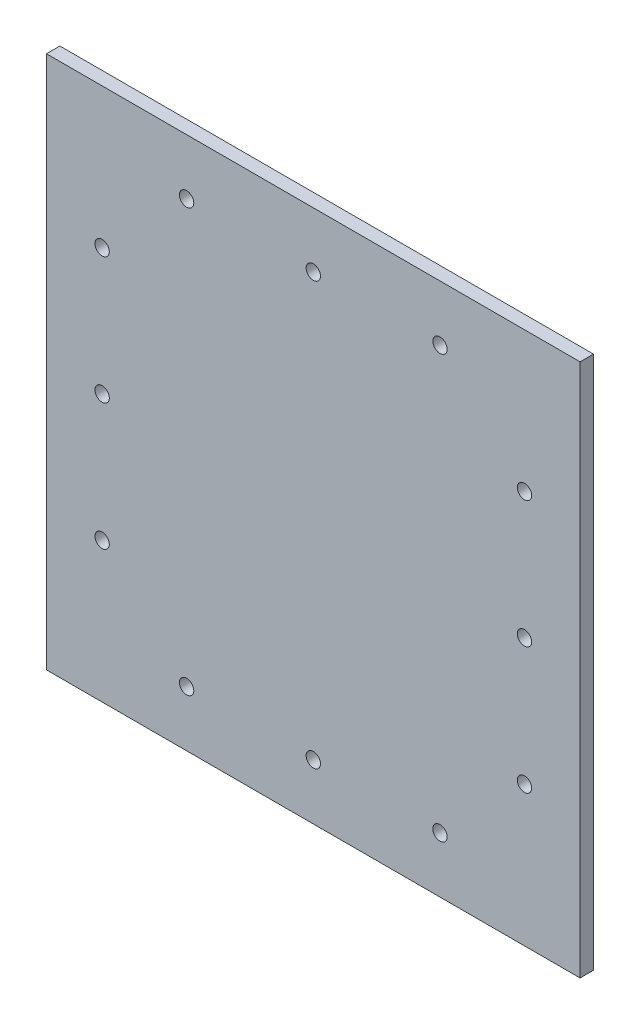
ISO-10303-21;
HEADER;
FILE_DESCRIPTION(('STEP AP214'),'2;1');
FILE_NAME('part.step','',(''),(''),'','','');
FILE_SCHEMA(('AUTOMOTIVE_DESIGN { 1 0 10303 214 1 1 1 1 }'));
ENDSEC;
DATA;
#1=APPLICATION_CONTEXT('core data for automotive mechanical design processes');
#2=APPLICATION_PROTOCOL_DEFINITION('international standard','automotive_design',2000,#1);
#3=PRODUCT_CONTEXT('',#1,'mechanical');
#4=PRODUCT('Part','Part','',(#3));
#5=PRODUCT_RELATED_PRODUCT_CATEGORY('part','',(#4));
#6=PRODUCT_DEFINITION_FORMATION('','',#4);
#7=PRODUCT_DEFINITION_CONTEXT('part definition',#1,'design');
#8=PRODUCT_DEFINITION('design','',#6,#7);
#9=PRODUCT_DEFINITION_SHAPE('','',#8);
#10=(LENGTH_UNIT() NAMED_UNIT(*) SI_UNIT(.MILLI.,.METRE.));
#11=(NAMED_UNIT(*) PLANE_ANGLE_UNIT() SI_UNIT($,.RADIAN.));
#12=(NAMED_UNIT(*) SI_UNIT($,.STERADIAN.) SOLID_ANGLE_UNIT());
#13=UNCERTAINTY_MEASURE_WITH_UNIT(LENGTH_MEASURE(1.E-05),#10,'distance_accuracy_value','');
#14=(GEOMETRIC_REPRESENTATION_CONTEXT(3) GLOBAL_UNCERTAINTY_ASSIGNED_CONTEXT((#13)) GLOBAL_UNIT_ASSIGNED_CONTEXT((#10,
#11,#12)) REPRESENTATION_CONTEXT('',''));
#15=CARTESIAN_POINT('',(0.,0.,0.));
#16=DIRECTION('',(0.,0.,1.));
#17=DIRECTION('',(1.,0.,0.));
#18=AXIS2_PLACEMENT_3D('',#15,#16,#17);
#19=CARTESIAN_POINT('',(-63.1749999999998,-63.175,3.175));
#20=DIRECTION('',(-1.,0.,0.));
#21=DIRECTION('',(0.,0.,1.));
#22=AXIS2_PLACEMENT_3D('',#19,#20,#21);
#23=PLANE('',#22);
#24=DIRECTION('',(0.,1.,0.));
#25=VECTOR('',#24,1.);
#26=CARTESIAN_POINT('',(-63.1749999999998,-63.175,0.));
#27=LINE('',#26,#25);
#28=CARTESIAN_POINT('',(-63.1749999999998,-63.175,0.));
#29=VERTEX_POINT('',#28);
#30=CARTESIAN_POINT('',(-63.1749999999998,63.175,0.));
#31=VERTEX_POINT('',#30);
#32=EDGE_CURVE('E99',#29,#31,#27,.T.);
#33=ORIENTED_EDGE('',*,*,#32,.F.);
#34=DIRECTION('',(0.,0.,-1.));
#35=VECTOR('',#34,1.);
#36=CARTESIAN_POINT('',(-63.1749999999998,-63.175,3.175));
#37=LINE('',#36,#35);
#38=CARTESIAN_POINT('',(-63.1749999999998,-63.175,3.175));
#39=VERTEX_POINT('',#38);
#40=EDGE_CURVE('E11',#39,#29,#37,.T.);
#41=ORIENTED_EDGE('',*,*,#40,.F.);
#42=DIRECTION('',(0.,1.,0.));
#43=VECTOR('',#42,1.);
#44=CARTESIAN_POINT('',(-63.1749999999998,-63.175,3.175));
#45=LINE('',#44,#43);
#46=CARTESIAN_POINT('',(-63.1749999999998,63.175,3.175));
#47=VERTEX_POINT('',#46);
#48=EDGE_CURVE('E93',#39,#47,#45,.T.);
#49=ORIENTED_EDGE('',*,*,#48,.T.);
#50=DIRECTION('',(0.,0.,-1.));
#51=VECTOR('',#50,1.);
#52=CARTESIAN_POINT('',(-63.1749999999998,63.175,3.175));
#53=LINE('',#52,#51);
#54=EDGE_CURVE('E36',#47,#31,#53,.T.);
#55=ORIENTED_EDGE('',*,*,#54,.T.);
#56=EDGE_LOOP('',(#33,#41,#49,#55));
#57=FACE_BOUND('',#56,.T.);
#58=ADVANCED_FACE('F33',(#57),#23,.T.);
#59=CARTESIAN_POINT('',(-63.1749999999998,-63.175,3.175));
#60=DIRECTION('',(0.,1.,0.));
#61=DIRECTION('',(0.,0.,1.));
#62=AXIS2_PLACEMENT_3D('',#59,#60,#61);
#63=PLANE('',#62);
#64=DIRECTION('',(1.,0.,0.));
#65=VECTOR('',#64,1.);
#66=CARTESIAN_POINT('',(-63.1749999999998,-63.175,0.));
#67=LINE('',#66,#65);
#68=CARTESIAN_POINT('',(63.1750000000002,-63.175,0.));
#69=VERTEX_POINT('',#68);
#70=EDGE_CURVE('E66',#29,#69,#67,.T.);
#71=ORIENTED_EDGE('',*,*,#70,.T.);
#72=DIRECTION('',(0.,0.,-1.));
#73=VECTOR('',#72,1.);
#74=CARTESIAN_POINT('',(63.1750000000002,-63.175,3.175));
#75=LINE('',#74,#73);
#76=CARTESIAN_POINT('',(63.1750000000002,-63.175,3.175));
#77=VERTEX_POINT('',#76);
#78=EDGE_CURVE('E42',#77,#69,#75,.T.);
#79=ORIENTED_EDGE('',*,*,#78,.F.);
#80=DIRECTION('',(1.,0.,0.));
#81=VECTOR('',#80,1.);
#82=CARTESIAN_POINT('',(-63.1749999999998,-63.175,3.175));
#83=LINE('',#82,#81);
#84=EDGE_CURVE('E83',#39,#77,#83,.T.);
#85=ORIENTED_EDGE('',*,*,#84,.F.);
#86=ORIENTED_EDGE('',*,*,#40,.T.);
#87=EDGE_LOOP('',(#71,#79,#85,#86));
#88=FACE_BOUND('',#87,.T.);
#89=ADVANCED_FACE('F110',(#88),#63,.F.);
#90=CARTESIAN_POINT('',(63.1750000000002,-63.175,3.175));
#91=DIRECTION('',(-1.,0.,0.));
#92=DIRECTION('',(0.,0.,1.));
#93=AXIS2_PLACEMENT_3D('',#90,#91,#92);
#94=PLANE('',#93);
#95=DIRECTION('',(0.,1.,0.));
#96=VECTOR('',#95,1.);
#97=CARTESIAN_POINT('',(63.1750000000002,-63.175,0.));
#98=LINE('',#97,#96);
#99=CARTESIAN_POINT('',(63.1750000000002,63.175,0.));
#100=VERTEX_POINT('',#99);
#101=EDGE_CURVE('E90',#69,#100,#98,.T.);
#102=ORIENTED_EDGE('',*,*,#101,.T.);
#103=DIRECTION('',(0.,0.,-1.));
#104=VECTOR('',#103,1.);
#105=CARTESIAN_POINT('',(63.1750000000002,63.175,3.175));
#106=LINE('',#105,#104);
#107=CARTESIAN_POINT('',(63.1750000000002,63.175,3.175));
#108=VERTEX_POINT('',#107);
#109=EDGE_CURVE('E87',#108,#100,#106,.T.);
#110=ORIENTED_EDGE('',*,*,#109,.F.);
#111=DIRECTION('',(0.,1.,0.));
#112=VECTOR('',#111,1.);
#113=CARTESIAN_POINT('',(63.1750000000002,-63.175,3.175));
#114=LINE('',#113,#112);
#115=EDGE_CURVE('E78',#77,#108,#114,.T.);
#116=ORIENTED_EDGE('',*,*,#115,.F.);
#117=ORIENTED_EDGE('',*,*,#78,.T.);
#118=EDGE_LOOP('',(#102,#110,#116,#117));
#119=FACE_BOUND('',#118,.T.);
#120=ADVANCED_FACE('F88',(#119),#94,.F.);
#121=CARTESIAN_POINT('',(-63.1749999999998,63.175,3.175));
#122=DIRECTION('',(0.,1.,0.));
#123=DIRECTION('',(0.,0.,1.));
#124=AXIS2_PLACEMENT_3D('',#121,#122,#123);
#125=PLANE('',#124);
#126=DIRECTION('',(1.,0.,0.));
#127=VECTOR('',#126,1.);
#128=CARTESIAN_POINT('',(-63.1749999999998,63.175,0.));
#129=LINE('',#128,#127);
#130=EDGE_CURVE('E102',#31,#100,#129,.T.);
#131=ORIENTED_EDGE('',*,*,#130,.F.);
#132=ORIENTED_EDGE('',*,*,#54,.F.);
#133=DIRECTION('',(1.,0.,0.));
#134=VECTOR('',#133,1.);
#135=CARTESIAN_POINT('',(-63.1749999999998,63.175,3.175));
#136=LINE('',#135,#134);
#137=EDGE_CURVE('E82',#47,#108,#136,.T.);
#138=ORIENTED_EDGE('',*,*,#137,.T.);
#139=ORIENTED_EDGE('',*,*,#109,.T.);
#140=EDGE_LOOP('',(#131,#132,#138,#139));
#141=FACE_BOUND('',#140,.T.);
#142=ADVANCED_FACE('F92',(#141),#125,.T.);
#143=CARTESIAN_POINT('',(0.,0.,3.175));
#144=DIRECTION('',(0.,0.,-1.));
#145=DIRECTION('',(-1.,0.,0.));
#146=AXIS2_PLACEMENT_3D('',#143,#144,#145);
#147=PLANE('',#146);
#148=CARTESIAN_POINT('',(-49.9999999999993,-30.0000000000005,3.175));
#149=DIRECTION('',(0.,0.,-1.));
#150=DIRECTION('',(-1.,0.,0.));
#151=AXIS2_PLACEMENT_3D('',#148,#149,#150);
#152=CIRCLE('',#151,1.7);
#153=CARTESIAN_POINT('',(-51.6999999999993,-30.0000000000005,3.175));
#154=VERTEX_POINT('',#153);
#155=EDGE_CURVE('E103',#154,#154,#152,.T.);
#156=ORIENTED_EDGE('',*,*,#155,.T.);
#157=EDGE_LOOP('',(#156));
#158=FACE_BOUND('',#157,.T.);
#159=CARTESIAN_POINT('',(-49.9999999999997,29.9999999999996,3.175));
#160=DIRECTION('',(0.,0.,-1.));
#161=DIRECTION('',(-1.,0.,0.));
#162=AXIS2_PLACEMENT_3D('',#159,#160,#161);
#163=CIRCLE('',#162,1.69999999999999);
#164=CARTESIAN_POINT('',(-51.6999999999997,29.9999999999996,3.175));
#165=VERTEX_POINT('',#164);
#166=EDGE_CURVE('E221',#165,#165,#163,.T.);
#167=ORIENTED_EDGE('',*,*,#166,.T.);
#168=EDGE_LOOP('',(#167));
#169=FACE_BOUND('',#168,.T.);
#170=CARTESIAN_POINT('',(-49.9999999999994,-4.78783679369599E-13,3.175));
#171=DIRECTION('',(0.,0.,-1.));
#172=DIRECTION('',(-1.,0.,0.));
#173=AXIS2_PLACEMENT_3D('',#170,#171,#172);
#174=CIRCLE('',#173,1.7);
#175=CARTESIAN_POINT('',(-51.6999999999994,-4.78783679369599E-13,3.175));
#176=VERTEX_POINT('',#175);
#177=EDGE_CURVE('E218',#176,#176,#174,.T.);
#178=ORIENTED_EDGE('',*,*,#177,.T.);
#179=EDGE_LOOP('',(#178));
#180=FACE_BOUND('',#179,.T.);
#181=CARTESIAN_POINT('',(50.,30.0000000000001,3.175));
#182=DIRECTION('',(0.,0.,-1.));
#183=DIRECTION('',(-1.,0.,0.));
#184=AXIS2_PLACEMENT_3D('',#181,#182,#183);
#185=CIRCLE('',#184,1.7);
#186=CARTESIAN_POINT('',(48.3,30.0000000000001,3.175));
#187=VERTEX_POINT('',#186);
#188=EDGE_CURVE('E215',#187,#187,#185,.T.);
#189=ORIENTED_EDGE('',*,*,#188,.T.);
#190=EDGE_LOOP('',(#189));
#191=FACE_BOUND('',#190,.T.);
#192=CARTESIAN_POINT('',(0.,49.9999999999996,3.175));
#193=DIRECTION('',(0.,0.,-1.));
#194=DIRECTION('',(-1.,0.,0.));
#195=AXIS2_PLACEMENT_3D('',#192,#193,#194);
#196=CIRCLE('',#195,1.7);
#197=CARTESIAN_POINT('',(-1.70000000000003,49.9999999999996,3.175));
#198=VERTEX_POINT('',#197);
#199=EDGE_CURVE('E212',#198,#198,#196,.T.);
#200=ORIENTED_EDGE('',*,*,#199,.T.);
#201=EDGE_LOOP('',(#200));
#202=FACE_BOUND('',#201,.T.);
#203=CARTESIAN_POINT('',(30.0000000000001,49.9999999999998,3.175));
#204=DIRECTION('',(0.,0.,-1.));
#205=DIRECTION('',(-1.,0.,0.));
#206=AXIS2_PLACEMENT_3D('',#203,#204,#205);
#207=CIRCLE('',#206,1.70000000000001);
#208=CARTESIAN_POINT('',(28.3000000000001,49.9999999999998,3.175));
#209=VERTEX_POINT('',#208);
#210=EDGE_CURVE('E209',#209,#209,#207,.T.);
#211=ORIENTED_EDGE('',*,*,#210,.T.);
#212=EDGE_LOOP('',(#211));
#213=FACE_BOUND('',#212,.T.);
#214=CARTESIAN_POINT('',(-30.,49.9999999999996,3.175));
#215=DIRECTION('',(0.,0.,-1.));
#216=DIRECTION('',(-1.,0.,0.));
#217=AXIS2_PLACEMENT_3D('',#214,#215,#216);
#218=CIRCLE('',#217,1.69999999999999);
#219=CARTESIAN_POINT('',(-31.7,49.9999999999996,3.175));
#220=VERTEX_POINT('',#219);
#221=EDGE_CURVE('E206',#220,#220,#218,.T.);
#222=ORIENTED_EDGE('',*,*,#221,.T.);
#223=EDGE_LOOP('',(#222));
#224=FACE_BOUND('',#223,.T.);
#225=CARTESIAN_POINT('',(50.,-30.,3.175));
#226=DIRECTION('',(0.,0.,-1.));
#227=DIRECTION('',(-1.,0.,0.));
#228=AXIS2_PLACEMENT_3D('',#225,#226,#227);
#229=CIRCLE('',#228,1.7);
#230=CARTESIAN_POINT('',(48.2999999999999,-30.,3.175));
#231=VERTEX_POINT('',#230);
#232=EDGE_CURVE('E203',#231,#231,#229,.T.);
#233=ORIENTED_EDGE('',*,*,#232,.T.);
#234=EDGE_LOOP('',(#233));
#235=FACE_BOUND('',#234,.T.);
#236=CARTESIAN_POINT('',(49.9999999999999,0.,3.175));
#237=DIRECTION('',(0.,0.,-1.));
#238=DIRECTION('',(-1.,0.,0.));
#239=AXIS2_PLACEMENT_3D('',#236,#237,#238);
#240=CIRCLE('',#239,1.7);
#241=CARTESIAN_POINT('',(48.2999999999999,0.,3.175));
#242=VERTEX_POINT('',#241);
#243=EDGE_CURVE('E194',#242,#242,#240,.T.);
#244=ORIENTED_EDGE('',*,*,#243,.T.);
#245=EDGE_LOOP('',(#244));
#246=FACE_BOUND('',#245,.T.);
#247=CARTESIAN_POINT('',(30.0000000000002,-49.9999999999999,3.175));
#248=DIRECTION('',(0.,0.,-1.));
#249=DIRECTION('',(-1.,0.,0.));
#250=AXIS2_PLACEMENT_3D('',#247,#248,#249);
#251=CIRCLE('',#250,1.7);
#252=CARTESIAN_POINT('',(28.3000000000002,-49.9999999999999,3.175));
#253=VERTEX_POINT('',#252);
#254=EDGE_CURVE('E190',#253,#253,#251,.T.);
#255=ORIENTED_EDGE('',*,*,#254,.T.);
#256=EDGE_LOOP('',(#255));
#257=FACE_BOUND('',#256,.T.);
#258=CARTESIAN_POINT('',(-29.9999999999999,-49.9999999999996,3.175));
#259=DIRECTION('',(0.,0.,-1.));
#260=DIRECTION('',(-1.,0.,0.));
#261=AXIS2_PLACEMENT_3D('',#258,#259,#260);
#262=CIRCLE('',#261,1.7);
#263=CARTESIAN_POINT('',(-31.6999999999999,-49.9999999999996,3.175));
#264=VERTEX_POINT('',#263);
#265=EDGE_CURVE('E188',#264,#264,#262,.T.);
#266=ORIENTED_EDGE('',*,*,#265,.T.);
#267=EDGE_LOOP('',(#266));
#268=FACE_BOUND('',#267,.T.);
#269=CARTESIAN_POINT('',(1.56125112837913E-13,-49.9999999999997,3.175));
#270=DIRECTION('',(0.,0.,-1.));
#271=DIRECTION('',(-1.,0.,0.));
#272=AXIS2_PLACEMENT_3D('',#269,#270,#271);
#273=CIRCLE('',#272,1.7);
#274=CARTESIAN_POINT('',(-1.69999999999984,-49.9999999999997,3.175));
#275=VERTEX_POINT('',#274);
#276=EDGE_CURVE('E191',#275,#275,#273,.T.);
#277=ORIENTED_EDGE('',*,*,#276,.T.);
#278=EDGE_LOOP('',(#277));
#279=FACE_BOUND('',#278,.T.);
#280=ORIENTED_EDGE('',*,*,#48,.F.);
#281=ORIENTED_EDGE('',*,*,#84,.T.);
#282=ORIENTED_EDGE('',*,*,#115,.T.);
#283=ORIENTED_EDGE('',*,*,#137,.F.);
#284=EDGE_LOOP('',(#280,#281,#282,#283));
#285=FACE_BOUND('',#284,.T.);
#286=ADVANCED_FACE('F81',(#158,#169,#180,#191,#202,#213,#224,#235,#246,#257,#268,#279,#285),
#147,.F.);
#287=CARTESIAN_POINT('',(0.,0.,0.));
#288=DIRECTION('',(0.,0.,-1.));
#289=DIRECTION('',(-1.,0.,0.));
#290=AXIS2_PLACEMENT_3D('',#287,#288,#289);
#291=PLANE('',#290);
#292=CARTESIAN_POINT('',(-49.9999999999993,-30.0000000000005,0.));
#293=DIRECTION('',(0.,0.,-1.));
#294=DIRECTION('',(-1.,0.,0.));
#295=AXIS2_PLACEMENT_3D('',#292,#293,#294);
#296=CIRCLE('',#295,1.7);
#297=CARTESIAN_POINT('',(-51.6999999999993,-30.0000000000005,0.));
#298=VERTEX_POINT('',#297);
#299=EDGE_CURVE('E256',#298,#298,#296,.T.);
#300=ORIENTED_EDGE('',*,*,#299,.F.);
#301=EDGE_LOOP('',(#300));
#302=FACE_BOUND('',#301,.T.);
#303=CARTESIAN_POINT('',(-49.9999999999997,29.9999999999996,0.));
#304=DIRECTION('',(0.,0.,-1.));
#305=DIRECTION('',(-1.,0.,0.));
#306=AXIS2_PLACEMENT_3D('',#303,#304,#305);
#307=CIRCLE('',#306,1.69999999999999);
#308=CARTESIAN_POINT('',(-51.6999999999997,29.9999999999996,0.));
#309=VERTEX_POINT('',#308);
#310=EDGE_CURVE('E259',#309,#309,#307,.T.);
#311=ORIENTED_EDGE('',*,*,#310,.F.);
#312=EDGE_LOOP('',(#311));
#313=FACE_BOUND('',#312,.T.);
#314=CARTESIAN_POINT('',(-49.9999999999994,-4.78783679369599E-13,0.));
#315=DIRECTION('',(0.,0.,-1.));
#316=DIRECTION('',(-1.,0.,0.));
#317=AXIS2_PLACEMENT_3D('',#314,#315,#316);
#318=CIRCLE('',#317,1.7);
#319=CARTESIAN_POINT('',(-51.6999999999994,-4.78783679369599E-13,0.));
#320=VERTEX_POINT('',#319);
#321=EDGE_CURVE('E262',#320,#320,#318,.T.);
#322=ORIENTED_EDGE('',*,*,#321,.F.);
#323=EDGE_LOOP('',(#322));
#324=FACE_BOUND('',#323,.T.);
#325=CARTESIAN_POINT('',(50.,30.0000000000001,0.));
#326=DIRECTION('',(0.,0.,-1.));
#327=DIRECTION('',(-1.,0.,0.));
#328=AXIS2_PLACEMENT_3D('',#325,#326,#327);
#329=CIRCLE('',#328,1.7);
#330=CARTESIAN_POINT('',(48.3,30.0000000000001,0.));
#331=VERTEX_POINT('',#330);
#332=EDGE_CURVE('E269',#331,#331,#329,.T.);
#333=ORIENTED_EDGE('',*,*,#332,.F.);
#334=EDGE_LOOP('',(#333));
#335=FACE_BOUND('',#334,.T.);
#336=CARTESIAN_POINT('',(0.,49.9999999999996,0.));
#337=DIRECTION('',(0.,0.,-1.));
#338=DIRECTION('',(-1.,0.,0.));
#339=AXIS2_PLACEMENT_3D('',#336,#337,#338);
#340=CIRCLE('',#339,1.7);
#341=CARTESIAN_POINT('',(-1.70000000000003,49.9999999999996,0.));
#342=VERTEX_POINT('',#341);
#343=EDGE_CURVE('E266',#342,#342,#340,.T.);
#344=ORIENTED_EDGE('',*,*,#343,.F.);
#345=EDGE_LOOP('',(#344));
#346=FACE_BOUND('',#345,.T.);
#347=CARTESIAN_POINT('',(30.0000000000001,49.9999999999998,0.));
#348=DIRECTION('',(0.,0.,-1.));
#349=DIRECTION('',(-1.,0.,0.));
#350=AXIS2_PLACEMENT_3D('',#347,#348,#349);
#351=CIRCLE('',#350,1.70000000000001);
#352=CARTESIAN_POINT('',(28.3000000000001,49.9999999999998,0.));
#353=VERTEX_POINT('',#352);
#354=EDGE_CURVE('E270',#353,#353,#351,.T.);
#355=ORIENTED_EDGE('',*,*,#354,.F.);
#356=EDGE_LOOP('',(#355));
#357=FACE_BOUND('',#356,.T.);
#358=CARTESIAN_POINT('',(-30.,49.9999999999996,0.));
#359=DIRECTION('',(0.,0.,-1.));
#360=DIRECTION('',(-1.,0.,0.));
#361=AXIS2_PLACEMENT_3D('',#358,#359,#360);
#362=CIRCLE('',#361,1.69999999999999);
#363=CARTESIAN_POINT('',(-31.7,49.9999999999996,0.));
#364=VERTEX_POINT('',#363);
#365=EDGE_CURVE('E265',#364,#364,#362,.T.);
#366=ORIENTED_EDGE('',*,*,#365,.F.);
#367=EDGE_LOOP('',(#366));
#368=FACE_BOUND('',#367,.T.);
#369=CARTESIAN_POINT('',(50.,-30.,0.));
#370=DIRECTION('',(0.,0.,-1.));
#371=DIRECTION('',(-1.,0.,0.));
#372=AXIS2_PLACEMENT_3D('',#369,#370,#371);
#373=CIRCLE('',#372,1.7);
#374=CARTESIAN_POINT('',(48.2999999999999,-30.,0.));
#375=VERTEX_POINT('',#374);
#376=EDGE_CURVE('E273',#375,#375,#373,.T.);
#377=ORIENTED_EDGE('',*,*,#376,.F.);
#378=EDGE_LOOP('',(#377));
#379=FACE_BOUND('',#378,.T.);
#380=CARTESIAN_POINT('',(49.9999999999999,0.,0.));
#381=DIRECTION('',(0.,0.,-1.));
#382=DIRECTION('',(-1.,0.,0.));
#383=AXIS2_PLACEMENT_3D('',#380,#381,#382);
#384=CIRCLE('',#383,1.7);
#385=CARTESIAN_POINT('',(48.2999999999999,0.,0.));
#386=VERTEX_POINT('',#385);
#387=EDGE_CURVE('E280',#386,#386,#384,.T.);
#388=ORIENTED_EDGE('',*,*,#387,.F.);
#389=EDGE_LOOP('',(#388));
#390=FACE_BOUND('',#389,.T.);
#391=CARTESIAN_POINT('',(30.0000000000002,-49.9999999999999,0.));
#392=DIRECTION('',(0.,0.,-1.));
#393=DIRECTION('',(-1.,0.,0.));
#394=AXIS2_PLACEMENT_3D('',#391,#392,#393);
#395=CIRCLE('',#394,1.7);
#396=CARTESIAN_POINT('',(28.3000000000002,-49.9999999999999,0.));
#397=VERTEX_POINT('',#396);
#398=EDGE_CURVE('E283',#397,#397,#395,.T.);
#399=ORIENTED_EDGE('',*,*,#398,.F.);
#400=EDGE_LOOP('',(#399));
#401=FACE_BOUND('',#400,.T.);
#402=CARTESIAN_POINT('',(-29.9999999999999,-49.9999999999996,0.));
#403=DIRECTION('',(0.,0.,-1.));
#404=DIRECTION('',(-1.,0.,0.));
#405=AXIS2_PLACEMENT_3D('',#402,#403,#404);
#406=CIRCLE('',#405,1.7);
#407=CARTESIAN_POINT('',(-31.6999999999999,-49.9999999999996,0.));
#408=VERTEX_POINT('',#407);
#409=EDGE_CURVE('E185',#408,#408,#406,.T.);
#410=ORIENTED_EDGE('',*,*,#409,.F.);
#411=EDGE_LOOP('',(#410));
#412=FACE_BOUND('',#411,.T.);
#413=CARTESIAN_POINT('',(1.56125112837913E-13,-49.9999999999997,0.));
#414=DIRECTION('',(0.,0.,-1.));
#415=DIRECTION('',(-1.,0.,0.));
#416=AXIS2_PLACEMENT_3D('',#413,#414,#415);
#417=CIRCLE('',#416,1.7);
#418=CARTESIAN_POINT('',(-1.69999999999984,-49.9999999999997,0.));
#419=VERTEX_POINT('',#418);
#420=EDGE_CURVE('E197',#419,#419,#417,.T.);
#421=ORIENTED_EDGE('',*,*,#420,.F.);
#422=EDGE_LOOP('',(#421));
#423=FACE_BOUND('',#422,.T.);
#424=ORIENTED_EDGE('',*,*,#32,.T.);
#425=ORIENTED_EDGE('',*,*,#130,.T.);
#426=ORIENTED_EDGE('',*,*,#101,.F.);
#427=ORIENTED_EDGE('',*,*,#70,.F.);
#428=EDGE_LOOP('',(#424,#425,#426,#427));
#429=FACE_BOUND('',#428,.T.);
#430=ADVANCED_FACE('F108',(#302,#313,#324,#335,#346,#357,#368,#379,#390,#401,#412,#423,#429),
#291,.T.);
#431=CARTESIAN_POINT('',(1.56125112837913E-13,-49.9999999999997,7.));
#432=DIRECTION('',(0.,0.,-1.));
#433=DIRECTION('',(-1.,0.,0.));
#434=AXIS2_PLACEMENT_3D('',#431,#432,#433);
#435=CYLINDRICAL_SURFACE('',#434,1.7);
#436=ORIENTED_EDGE('',*,*,#420,.T.);
#437=EDGE_LOOP('',(#436));
#438=FACE_BOUND('',#437,.T.);
#439=ORIENTED_EDGE('',*,*,#276,.F.);
#440=EDGE_LOOP('',(#439));
#441=FACE_BOUND('',#440,.T.);
#442=ADVANCED_FACE('F129',(#438,#441),#435,.F.);
#443=CARTESIAN_POINT('',(-29.9999999999999,-49.9999999999996,7.));
#444=DIRECTION('',(0.,0.,-1.));
#445=DIRECTION('',(-1.,0.,0.));
#446=AXIS2_PLACEMENT_3D('',#443,#444,#445);
#447=CYLINDRICAL_SURFACE('',#446,1.7);
#448=ORIENTED_EDGE('',*,*,#409,.T.);
#449=EDGE_LOOP('',(#448));
#450=FACE_BOUND('',#449,.T.);
#451=ORIENTED_EDGE('',*,*,#265,.F.);
#452=EDGE_LOOP('',(#451));
#453=FACE_BOUND('',#452,.T.);
#454=ADVANCED_FACE('F136',(#450,#453),#447,.F.);
#455=CARTESIAN_POINT('',(30.0000000000002,-49.9999999999999,7.));
#456=DIRECTION('',(0.,0.,-1.));
#457=DIRECTION('',(-1.,0.,0.));
#458=AXIS2_PLACEMENT_3D('',#455,#456,#457);
#459=CYLINDRICAL_SURFACE('',#458,1.7);
#460=ORIENTED_EDGE('',*,*,#398,.T.);
#461=EDGE_LOOP('',(#460));
#462=FACE_BOUND('',#461,.T.);
#463=ORIENTED_EDGE('',*,*,#254,.F.);
#464=EDGE_LOOP('',(#463));
#465=FACE_BOUND('',#464,.T.);
#466=ADVANCED_FACE('F173',(#462,#465),#459,.F.);
#467=CARTESIAN_POINT('',(49.9999999999999,0.,7.));
#468=DIRECTION('',(0.,0.,-1.));
#469=DIRECTION('',(-1.,0.,0.));
#470=AXIS2_PLACEMENT_3D('',#467,#468,#469);
#471=CYLINDRICAL_SURFACE('',#470,1.7);
#472=ORIENTED_EDGE('',*,*,#387,.T.);
#473=EDGE_LOOP('',(#472));
#474=FACE_BOUND('',#473,.T.);
#475=ORIENTED_EDGE('',*,*,#243,.F.);
#476=EDGE_LOOP('',(#475));
#477=FACE_BOUND('',#476,.T.);
#478=ADVANCED_FACE('F169',(#474,#477),#471,.F.);
#479=CARTESIAN_POINT('',(50.,-30.,7.));
#480=DIRECTION('',(0.,0.,-1.));
#481=DIRECTION('',(-1.,0.,0.));
#482=AXIS2_PLACEMENT_3D('',#479,#480,#481);
#483=CYLINDRICAL_SURFACE('',#482,1.7);
#484=ORIENTED_EDGE('',*,*,#376,.T.);
#485=EDGE_LOOP('',(#484));
#486=FACE_BOUND('',#485,.T.);
#487=ORIENTED_EDGE('',*,*,#232,.F.);
#488=EDGE_LOOP('',(#487));
#489=FACE_BOUND('',#488,.T.);
#490=ADVANCED_FACE('F162',(#486,#489),#483,.F.);
#491=CARTESIAN_POINT('',(-30.,49.9999999999996,7.));
#492=DIRECTION('',(0.,0.,-1.));
#493=DIRECTION('',(-1.,0.,0.));
#494=AXIS2_PLACEMENT_3D('',#491,#492,#493);
#495=CYLINDRICAL_SURFACE('',#494,1.69999999999999);
#496=ORIENTED_EDGE('',*,*,#365,.T.);
#497=EDGE_LOOP('',(#496));
#498=FACE_BOUND('',#497,.T.);
#499=ORIENTED_EDGE('',*,*,#221,.F.);
#500=EDGE_LOOP('',(#499));
#501=FACE_BOUND('',#500,.T.);
#502=ADVANCED_FACE('F159',(#498,#501),#495,.F.);
#503=CARTESIAN_POINT('',(30.0000000000001,49.9999999999998,7.));
#504=DIRECTION('',(0.,0.,-1.));
#505=DIRECTION('',(-1.,0.,0.));
#506=AXIS2_PLACEMENT_3D('',#503,#504,#505);
#507=CYLINDRICAL_SURFACE('',#506,1.70000000000001);
#508=ORIENTED_EDGE('',*,*,#354,.T.);
#509=EDGE_LOOP('',(#508));
#510=FACE_BOUND('',#509,.T.);
#511=ORIENTED_EDGE('',*,*,#210,.F.);
#512=EDGE_LOOP('',(#511));
#513=FACE_BOUND('',#512,.T.);
#514=ADVANCED_FACE('F154',(#510,#513),#507,.F.);
#515=CARTESIAN_POINT('',(0.,49.9999999999996,7.));
#516=DIRECTION('',(0.,0.,-1.));
#517=DIRECTION('',(-1.,0.,0.));
#518=AXIS2_PLACEMENT_3D('',#515,#516,#517);
#519=CYLINDRICAL_SURFACE('',#518,1.7);
#520=ORIENTED_EDGE('',*,*,#343,.T.);
#521=EDGE_LOOP('',(#520));
#522=FACE_BOUND('',#521,.T.);
#523=ORIENTED_EDGE('',*,*,#199,.F.);
#524=EDGE_LOOP('',(#523));
#525=FACE_BOUND('',#524,.T.);
#526=ADVANCED_FACE('F151',(#522,#525),#519,.F.);
#527=CARTESIAN_POINT('',(50.,30.0000000000001,7.));
#528=DIRECTION('',(0.,0.,-1.));
#529=DIRECTION('',(-1.,0.,0.));
#530=AXIS2_PLACEMENT_3D('',#527,#528,#529);
#531=CYLINDRICAL_SURFACE('',#530,1.7);
#532=ORIENTED_EDGE('',*,*,#332,.T.);
#533=EDGE_LOOP('',(#532));
#534=FACE_BOUND('',#533,.T.);
#535=ORIENTED_EDGE('',*,*,#188,.F.);
#536=EDGE_LOOP('',(#535));
#537=FACE_BOUND('',#536,.T.);
#538=ADVANCED_FACE('F149',(#534,#537),#531,.F.);
#539=CARTESIAN_POINT('',(-49.9999999999994,-4.78783679369599E-13,7.));
#540=DIRECTION('',(0.,0.,-1.));
#541=DIRECTION('',(-1.,0.,0.));
#542=AXIS2_PLACEMENT_3D('',#539,#540,#541);
#543=CYLINDRICAL_SURFACE('',#542,1.7);
#544=ORIENTED_EDGE('',*,*,#321,.T.);
#545=EDGE_LOOP('',(#544));
#546=FACE_BOUND('',#545,.T.);
#547=ORIENTED_EDGE('',*,*,#177,.F.);
#548=EDGE_LOOP('',(#547));
#549=FACE_BOUND('',#548,.T.);
#550=ADVANCED_FACE('F145',(#546,#549),#543,.F.);
#551=CARTESIAN_POINT('',(-49.9999999999997,29.9999999999996,7.));
#552=DIRECTION('',(0.,0.,-1.));
#553=DIRECTION('',(-1.,0.,0.));
#554=AXIS2_PLACEMENT_3D('',#551,#552,#553);
#555=CYLINDRICAL_SURFACE('',#554,1.69999999999999);
#556=ORIENTED_EDGE('',*,*,#310,.T.);
#557=EDGE_LOOP('',(#556));
#558=FACE_BOUND('',#557,.T.);
#559=ORIENTED_EDGE('',*,*,#166,.F.);
#560=EDGE_LOOP('',(#559));
#561=FACE_BOUND('',#560,.T.);
#562=ADVANCED_FACE('F141',(#558,#561),#555,.F.);
#563=CARTESIAN_POINT('',(-49.9999999999993,-30.0000000000005,7.));
#564=DIRECTION('',(0.,0.,-1.));
#565=DIRECTION('',(-1.,0.,0.));
#566=AXIS2_PLACEMENT_3D('',#563,#564,#565);
#567=CYLINDRICAL_SURFACE('',#566,1.7);
#568=ORIENTED_EDGE('',*,*,#299,.T.);
#569=EDGE_LOOP('',(#568));
#570=FACE_BOUND('',#569,.T.);
#571=ORIENTED_EDGE('',*,*,#155,.F.);
#572=EDGE_LOOP('',(#571));
#573=FACE_BOUND('',#572,.T.);
#574=ADVANCED_FACE('F138',(#570,#573),#567,.F.);
#575=CLOSED_SHELL('',(#58,#89,#120,#142,#286,#430,#442,#454,#466,#478,#490,#502,#514,#526,#538,
#550,#562,#574));
#576=MANIFOLD_SOLID_BREP('B2',#575);
#577=ADVANCED_BREP_SHAPE_REPRESENTATION('',(#18,#576),#14);
#578=SHAPE_DEFINITION_REPRESENTATION(#9,#577);
ENDSEC;
END-ISO-10303-21;
